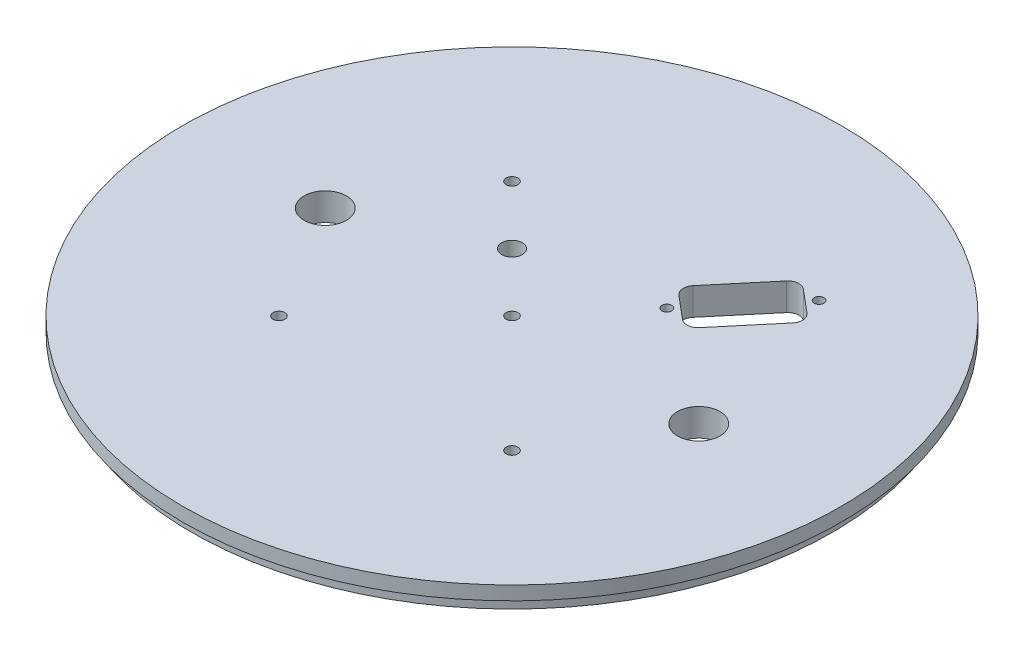
ISO-10303-21;
HEADER;
FILE_DESCRIPTION(('STEP AP214'),'2;1');
FILE_NAME('part.step','',(''),(''),'','','');
FILE_SCHEMA(('AUTOMOTIVE_DESIGN { 1 0 10303 214 1 1 1 1 }'));
ENDSEC;
DATA;
#1=APPLICATION_CONTEXT('core data for automotive mechanical design processes');
#2=APPLICATION_PROTOCOL_DEFINITION('international standard','automotive_design',2000,#1);
#3=PRODUCT_CONTEXT('',#1,'mechanical');
#4=PRODUCT('Part','Part','',(#3));
#5=PRODUCT_RELATED_PRODUCT_CATEGORY('part','',(#4));
#6=PRODUCT_DEFINITION_FORMATION('','',#4);
#7=PRODUCT_DEFINITION_CONTEXT('part definition',#1,'design');
#8=PRODUCT_DEFINITION('design','',#6,#7);
#9=PRODUCT_DEFINITION_SHAPE('','',#8);
#10=(LENGTH_UNIT() NAMED_UNIT(*) SI_UNIT(.MILLI.,.METRE.));
#11=(NAMED_UNIT(*) PLANE_ANGLE_UNIT() SI_UNIT($,.RADIAN.));
#12=(NAMED_UNIT(*) SI_UNIT($,.STERADIAN.) SOLID_ANGLE_UNIT());
#13=UNCERTAINTY_MEASURE_WITH_UNIT(LENGTH_MEASURE(1.E-05),#10,'distance_accuracy_value','');
#14=(GEOMETRIC_REPRESENTATION_CONTEXT(3) GLOBAL_UNCERTAINTY_ASSIGNED_CONTEXT((#13)) GLOBAL_UNIT_ASSIGNED_CONTEXT((#10,
#11,#12)) REPRESENTATION_CONTEXT('',''));
#15=CARTESIAN_POINT('',(0.,0.,0.));
#16=DIRECTION('',(0.,0.,1.));
#17=DIRECTION('',(1.,0.,0.));
#18=AXIS2_PLACEMENT_3D('',#15,#16,#17);
#19=CARTESIAN_POINT('',(0.,0.,0.));
#20=DIRECTION('',(0.,1.,0.));
#21=DIRECTION('',(0.,0.,1.));
#22=AXIS2_PLACEMENT_3D('',#19,#20,#21);
#23=PLANE('',#22);
#24=DIRECTION('',(-0.76604444311898,0.,-0.642787609686537));
#25=VECTOR('',#24,1.);
#26=CARTESIAN_POINT('',(28.300316681429,0.,-39.0615810789514));
#27=LINE('',#26,#25);
#28=CARTESIAN_POINT('',(33.553849472339,0.,-34.6533436517211));
#29=VERTEX_POINT('',#28);
#30=CARTESIAN_POINT('',(28.300316681429,0.,-39.0615810789514));
#31=VERTEX_POINT('',#30);
#32=EDGE_CURVE('E166',#29,#31,#27,.T.);
#33=ORIENTED_EDGE('',*,*,#32,.T.);
#34=CARTESIAN_POINT('',(26.6676361528252,0.,-37.1158281934292));
#35=DIRECTION('',(0.,1.,0.));
#36=DIRECTION('',(0.,0.,-1.));
#37=AXIS2_PLACEMENT_3D('',#34,#35,#36);
#38=CIRCLE('',#37,2.54);
#39=CARTESIAN_POINT('',(24.721883267303,0.,-38.748508722033));
#40=VERTEX_POINT('',#39);
#41=EDGE_CURVE('E159',#31,#40,#38,.T.);
#42=ORIENTED_EDGE('',*,*,#41,.T.);
#43=DIRECTION('',(-0.642787609686538,0.,0.766044443118979));
#44=VECTOR('',#43,1.);
#45=CARTESIAN_POINT('',(14.8563790094081,0.,-26.9912585799332));
#46=LINE('',#45,#44);
#47=CARTESIAN_POINT('',(14.8563790094081,0.,-26.9912585799332));
#48=VERTEX_POINT('',#47);
#49=EDGE_CURVE('E169',#40,#48,#46,.T.);
#50=ORIENTED_EDGE('',*,*,#49,.T.);
#51=CARTESIAN_POINT('',(16.8021318949303,0.,-25.3585780513294));
#52=DIRECTION('',(0.,1.,0.));
#53=DIRECTION('',(0.,0.,1.));
#54=AXIS2_PLACEMENT_3D('',#51,#52,#53);
#55=CIRCLE('',#54,2.54);
#56=CARTESIAN_POINT('',(15.1694513663265,0.,-23.4128251658072));
#57=VERTEX_POINT('',#56);
#58=EDGE_CURVE('E59',#48,#57,#55,.T.);
#59=ORIENTED_EDGE('',*,*,#58,.T.);
#60=DIRECTION('',(0.766044443118979,0.,0.642787609686537));
#61=VECTOR('',#60,1.);
#62=CARTESIAN_POINT('',(15.1694513663265,0.,-23.4128251658072));
#63=LINE('',#62,#61);
#64=CARTESIAN_POINT('',(20.4229841572365,0.,-19.0045877385769));
#65=VERTEX_POINT('',#64);
#66=EDGE_CURVE('E187',#57,#65,#63,.T.);
#67=ORIENTED_EDGE('',*,*,#66,.T.);
#68=CARTESIAN_POINT('',(22.0556646858403,0.,-20.9503406240991));
#69=DIRECTION('',(0.,1.,0.));
#70=DIRECTION('',(0.,0.,1.));
#71=AXIS2_PLACEMENT_3D('',#68,#69,#70);
#72=CIRCLE('',#71,2.54);
#73=CARTESIAN_POINT('',(24.0014175713625,0.,-19.3176600954953));
#74=VERTEX_POINT('',#73);
#75=EDGE_CURVE('E191',#65,#74,#72,.T.);
#76=ORIENTED_EDGE('',*,*,#75,.T.);
#77=DIRECTION('',(0.642787609686538,0.,-0.766044443118979));
#78=VECTOR('',#77,1.);
#79=CARTESIAN_POINT('',(24.0014175713625,0.,-19.3176600954953));
#80=LINE('',#79,#78);
#81=CARTESIAN_POINT('',(33.8669218292574,0.,-31.0749102375951));
#82=VERTEX_POINT('',#81);
#83=EDGE_CURVE('E195',#74,#82,#80,.T.);
#84=ORIENTED_EDGE('',*,*,#83,.T.);
#85=CARTESIAN_POINT('',(31.9211689437352,0.,-32.7075907661989));
#86=DIRECTION('',(0.,1.,0.));
#87=DIRECTION('',(0.,0.,1.));
#88=AXIS2_PLACEMENT_3D('',#85,#86,#87);
#89=CIRCLE('',#88,2.54);
#90=EDGE_CURVE('E199',#82,#29,#89,.T.);
#91=ORIENTED_EDGE('',*,*,#90,.T.);
#92=EDGE_LOOP('',(#33,#42,#50,#59,#67,#76,#84,#91));
#93=FACE_BOUND('',#92,.T.);
#94=CARTESIAN_POINT('',(16.3268052860381,0.,-19.4575288552221));
#95=DIRECTION('',(0.,1.,0.));
#96=DIRECTION('',(0.,0.,1.));
#97=AXIS2_PLACEMENT_3D('',#94,#95,#96);
#98=CIRCLE('',#97,1.1303);
#99=CARTESIAN_POINT('',(16.3268052860381,0.,-18.3272288552221));
#100=VERTEX_POINT('',#99);
#101=EDGE_CURVE('E252',#100,#100,#98,.T.);
#102=ORIENTED_EDGE('',*,*,#101,.T.);
#103=EDGE_LOOP('',(#102));
#104=FACE_BOUND('',#103,.T.);
#105=CARTESIAN_POINT('',(32.3964955526274,0.,-38.6086399623062));
#106=DIRECTION('',(0.,1.,0.));
#107=DIRECTION('',(0.,0.,1.));
#108=AXIS2_PLACEMENT_3D('',#105,#106,#107);
#109=CIRCLE('',#108,1.1303);
#110=CARTESIAN_POINT('',(32.3964955526274,0.,-37.4783399623062));
#111=VERTEX_POINT('',#110);
#112=EDGE_CURVE('E260',#111,#111,#109,.T.);
#113=ORIENTED_EDGE('',*,*,#112,.T.);
#114=EDGE_LOOP('',(#113));
#115=FACE_BOUND('',#114,.T.);
#116=DIRECTION('',(0.,0.,-1.));
#117=VECTOR('',#116,1.);
#118=CARTESIAN_POINT('',(3.23850000000001,0.,0.));
#119=LINE('',#118,#117);
#120=CARTESIAN_POINT('',(3.23850000000001,0.,-13.97));
#121=VERTEX_POINT('',#120);
#122=CARTESIAN_POINT('',(3.23850000000001,0.,-34.798));
#123=VERTEX_POINT('',#122);
#124=EDGE_CURVE('E52',#121,#123,#119,.T.);
#125=ORIENTED_EDGE('',*,*,#124,.T.);
#126=CARTESIAN_POINT('',(0.,0.,-34.798));
#127=DIRECTION('',(0.,1.,0.));
#128=DIRECTION('',(0.,0.,1.));
#129=AXIS2_PLACEMENT_3D('',#126,#127,#128);
#130=CIRCLE('',#129,3.2385);
#131=CARTESIAN_POINT('',(-3.23849999999999,0.,-34.798));
#132=VERTEX_POINT('',#131);
#133=EDGE_CURVE('E11',#123,#132,#130,.T.);
#134=ORIENTED_EDGE('',*,*,#133,.T.);
#135=DIRECTION('',(0.,0.,1.));
#136=VECTOR('',#135,1.);
#137=CARTESIAN_POINT('',(-3.23849999999999,0.,0.));
#138=LINE('',#137,#136);
#139=CARTESIAN_POINT('',(-3.23849999999999,0.,-13.97));
#140=VERTEX_POINT('',#139);
#141=EDGE_CURVE('E408',#132,#140,#138,.T.);
#142=ORIENTED_EDGE('',*,*,#141,.T.);
#143=CARTESIAN_POINT('',(0.,0.,-13.97));
#144=DIRECTION('',(0.,1.,0.));
#145=DIRECTION('',(0.,0.,1.));
#146=AXIS2_PLACEMENT_3D('',#143,#144,#145);
#147=CIRCLE('',#146,3.2385);
#148=EDGE_CURVE('E412',#140,#121,#147,.T.);
#149=ORIENTED_EDGE('',*,*,#148,.T.);
#150=EDGE_LOOP('',(#125,#134,#142,#149));
#151=FACE_BOUND('',#150,.T.);
#152=DIRECTION('',(0.,0.,1.));
#153=VECTOR('',#152,1.);
#154=CARTESIAN_POINT('',(-3.23850000000005,0.,0.));
#155=LINE('',#154,#153);
#156=CARTESIAN_POINT('',(-3.23850000000005,0.,13.97));
#157=VERTEX_POINT('',#156);
#158=CARTESIAN_POINT('',(-3.23850000000005,0.,34.798));
#159=VERTEX_POINT('',#158);
#160=EDGE_CURVE('E400',#157,#159,#155,.T.);
#161=ORIENTED_EDGE('',*,*,#160,.T.);
#162=CARTESIAN_POINT('',(0.,0.,34.798));
#163=DIRECTION('',(0.,1.,0.));
#164=DIRECTION('',(0.,0.,1.));
#165=AXIS2_PLACEMENT_3D('',#162,#163,#164);
#166=CIRCLE('',#165,3.2385);
#167=CARTESIAN_POINT('',(3.23849999999995,0.,34.798));
#168=VERTEX_POINT('',#167);
#169=EDGE_CURVE('E404',#159,#168,#166,.T.);
#170=ORIENTED_EDGE('',*,*,#169,.T.);
#171=DIRECTION('',(0.,0.,-1.));
#172=VECTOR('',#171,1.);
#173=CARTESIAN_POINT('',(3.23849999999995,0.,0.));
#174=LINE('',#173,#172);
#175=CARTESIAN_POINT('',(3.23849999999995,0.,13.97));
#176=VERTEX_POINT('',#175);
#177=EDGE_CURVE('E392',#168,#176,#174,.T.);
#178=ORIENTED_EDGE('',*,*,#177,.T.);
#179=CARTESIAN_POINT('',(0.,0.,13.97));
#180=DIRECTION('',(0.,1.,0.));
#181=DIRECTION('',(0.,0.,1.));
#182=AXIS2_PLACEMENT_3D('',#179,#180,#181);
#183=CIRCLE('',#182,3.2385);
#184=EDGE_CURVE('E396',#176,#157,#183,.T.);
#185=ORIENTED_EDGE('',*,*,#184,.T.);
#186=EDGE_LOOP('',(#161,#170,#178,#185));
#187=FACE_BOUND('',#186,.T.);
#188=CARTESIAN_POINT('',(0.,0.,0.));
#189=DIRECTION('',(0.,1.,0.));
#190=DIRECTION('',(0.,0.,1.));
#191=AXIS2_PLACEMENT_3D('',#188,#189,#190);
#192=CIRCLE('',#191,1.3589);
#193=CARTESIAN_POINT('',(0.,0.,1.3589));
#194=VERTEX_POINT('',#193);
#195=EDGE_CURVE('E332',#194,#194,#192,.T.);
#196=ORIENTED_EDGE('',*,*,#195,.T.);
#197=EDGE_LOOP('',(#196));
#198=FACE_BOUND('',#197,.T.);
#199=CARTESIAN_POINT('',(-26.9407683632074,0.,26.9407683632075));
#200=DIRECTION('',(0.,1.,0.));
#201=DIRECTION('',(0.,0.,1.));
#202=AXIS2_PLACEMENT_3D('',#199,#200,#201);
#203=CIRCLE('',#202,1.3589);
#204=CARTESIAN_POINT('',(-26.9407683632074,0.,28.2996683632075));
#205=VERTEX_POINT('',#204);
#206=EDGE_CURVE('E337',#205,#205,#203,.T.);
#207=ORIENTED_EDGE('',*,*,#206,.T.);
#208=EDGE_LOOP('',(#207));
#209=FACE_BOUND('',#208,.T.);
#210=CARTESIAN_POINT('',(-13.4703841816037,0.,-13.4703841816038));
#211=DIRECTION('',(0.,1.,0.));
#212=DIRECTION('',(0.,0.,1.));
#213=AXIS2_PLACEMENT_3D('',#210,#211,#212);
#214=CIRCLE('',#213,2.38125);
#215=CARTESIAN_POINT('',(-13.4703841816037,0.,-11.0891341816038));
#216=VERTEX_POINT('',#215);
#217=EDGE_CURVE('E345',#216,#216,#214,.T.);
#218=ORIENTED_EDGE('',*,*,#217,.T.);
#219=EDGE_LOOP('',(#218));
#220=FACE_BOUND('',#219,.T.);
#221=CARTESIAN_POINT('',(26.9407683632076,0.,26.9407683632073));
#222=DIRECTION('',(0.,1.,0.));
#223=DIRECTION('',(0.,0.,-1.));
#224=AXIS2_PLACEMENT_3D('',#221,#222,#223);
#225=CIRCLE('',#224,1.3589);
#226=CARTESIAN_POINT('',(26.9407683632076,0.,25.5818683632073));
#227=VERTEX_POINT('',#226);
#228=EDGE_CURVE('E353',#227,#227,#225,.T.);
#229=ORIENTED_EDGE('',*,*,#228,.T.);
#230=EDGE_LOOP('',(#229));
#231=FACE_BOUND('',#230,.T.);
#232=CARTESIAN_POINT('',(-26.9407683632074,0.,-26.9407683632075));
#233=DIRECTION('',(0.,1.,0.));
#234=DIRECTION('',(0.,0.,1.));
#235=AXIS2_PLACEMENT_3D('',#232,#233,#234);
#236=CIRCLE('',#235,1.3589);
#237=CARTESIAN_POINT('',(-26.9407683632074,0.,-25.5818683632075));
#238=VERTEX_POINT('',#237);
#239=EDGE_CURVE('E361',#238,#238,#236,.T.);
#240=ORIENTED_EDGE('',*,*,#239,.T.);
#241=EDGE_LOOP('',(#240));
#242=FACE_BOUND('',#241,.T.);
#243=CARTESIAN_POINT('',(-43.18,0.,0.));
#244=DIRECTION('',(0.,1.,0.));
#245=DIRECTION('',(0.,0.,-1.));
#246=AXIS2_PLACEMENT_3D('',#243,#244,#245);
#247=CIRCLE('',#246,4.9022);
#248=CARTESIAN_POINT('',(-43.18,0.,-4.9022));
#249=VERTEX_POINT('',#248);
#250=EDGE_CURVE('E369',#249,#249,#247,.T.);
#251=ORIENTED_EDGE('',*,*,#250,.T.);
#252=EDGE_LOOP('',(#251));
#253=FACE_BOUND('',#252,.T.);
#254=CARTESIAN_POINT('',(43.18,0.,0.));
#255=DIRECTION('',(0.,1.,0.));
#256=DIRECTION('',(0.,0.,1.));
#257=AXIS2_PLACEMENT_3D('',#254,#255,#256);
#258=CIRCLE('',#257,4.9022);
#259=CARTESIAN_POINT('',(43.18,0.,4.9022));
#260=VERTEX_POINT('',#259);
#261=EDGE_CURVE('E377',#260,#260,#258,.T.);
#262=ORIENTED_EDGE('',*,*,#261,.T.);
#263=EDGE_LOOP('',(#262));
#264=FACE_BOUND('',#263,.T.);
#265=CARTESIAN_POINT('',(0.,0.,0.));
#266=DIRECTION('',(0.,-1.,0.));
#267=DIRECTION('',(0.,0.,-1.));
#268=AXIS2_PLACEMENT_3D('',#265,#266,#267);
#269=CIRCLE('',#268,74.041);
#270=CARTESIAN_POINT('',(0.,0.,-74.041));
#271=VERTEX_POINT('',#270);
#272=EDGE_CURVE('E286',#271,#271,#269,.T.);
#273=ORIENTED_EDGE('',*,*,#272,.T.);
#274=EDGE_LOOP('',(#273));
#275=FACE_BOUND('',#274,.T.);
#276=ADVANCED_FACE('F43',(#93,#104,#115,#151,#187,#198,#209,#220,#231,#242,#253,#264,#275),#23,.F.);
#277=CARTESIAN_POINT('',(0.,6.35,0.));
#278=DIRECTION('',(0.,-1.,0.));
#279=DIRECTION('',(0.,0.,-1.));
#280=AXIS2_PLACEMENT_3D('',#277,#278,#279);
#281=CYLINDRICAL_SURFACE('',#280,76.2);
#282=CARTESIAN_POINT('',(0.,6.35,0.));
#283=DIRECTION('',(0.,1.,0.));
#284=DIRECTION('',(0.,0.,1.));
#285=AXIS2_PLACEMENT_3D('',#282,#283,#284);
#286=CIRCLE('',#285,76.2);
#287=CARTESIAN_POINT('',(0.,6.35,76.2));
#288=VERTEX_POINT('',#287);
#289=EDGE_CURVE('E385',#288,#288,#286,.T.);
#290=ORIENTED_EDGE('',*,*,#289,.F.);
#291=EDGE_LOOP('',(#290));
#292=FACE_BOUND('',#291,.T.);
#293=CARTESIAN_POINT('',(0.,3.175,0.));
#294=DIRECTION('',(0.,-1.,0.));
#295=DIRECTION('',(0.,0.,-1.));
#296=AXIS2_PLACEMENT_3D('',#293,#294,#295);
#297=CIRCLE('',#296,76.2);
#298=CARTESIAN_POINT('',(0.,3.175,-76.2));
#299=VERTEX_POINT('',#298);
#300=EDGE_CURVE('E325',#299,#299,#297,.T.);
#301=ORIENTED_EDGE('',*,*,#300,.F.);
#302=EDGE_LOOP('',(#301));
#303=FACE_BOUND('',#302,.T.);
#304=ADVANCED_FACE('F45',(#292,#303),#281,.T.);
#305=CARTESIAN_POINT('',(0.,6.35,0.));
#306=DIRECTION('',(0.,1.,0.));
#307=DIRECTION('',(0.,0.,1.));
#308=AXIS2_PLACEMENT_3D('',#305,#306,#307);
#309=PLANE('',#308);
#310=CARTESIAN_POINT('',(26.6676361528252,6.35,-37.1158281934292));
#311=DIRECTION('',(0.,1.,0.));
#312=DIRECTION('',(0.,0.,-1.));
#313=AXIS2_PLACEMENT_3D('',#310,#311,#312);
#314=CIRCLE('',#313,2.54);
#315=CARTESIAN_POINT('',(28.300316681429,6.35,-39.0615810789514));
#316=VERTEX_POINT('',#315);
#317=CARTESIAN_POINT('',(24.721883267303,6.35,-38.748508722033));
#318=VERTEX_POINT('',#317);
#319=EDGE_CURVE('E67',#316,#318,#314,.T.);
#320=ORIENTED_EDGE('',*,*,#319,.F.);
#321=DIRECTION('',(-0.76604444311898,0.,-0.642787609686537));
#322=VECTOR('',#321,1.);
#323=CARTESIAN_POINT('',(28.300316681429,6.35,-39.0615810789514));
#324=LINE('',#323,#322);
#325=CARTESIAN_POINT('',(33.553849472339,6.35,-34.6533436517211));
#326=VERTEX_POINT('',#325);
#327=EDGE_CURVE('E178',#326,#316,#324,.T.);
#328=ORIENTED_EDGE('',*,*,#327,.F.);
#329=CARTESIAN_POINT('',(31.9211689437352,6.35,-32.7075907661989));
#330=DIRECTION('',(0.,1.,0.));
#331=DIRECTION('',(0.,0.,1.));
#332=AXIS2_PLACEMENT_3D('',#329,#330,#331);
#333=CIRCLE('',#332,2.54);
#334=CARTESIAN_POINT('',(33.8669218292574,6.35,-31.0749102375951));
#335=VERTEX_POINT('',#334);
#336=EDGE_CURVE('E182',#335,#326,#333,.T.);
#337=ORIENTED_EDGE('',*,*,#336,.F.);
#338=DIRECTION('',(0.642787609686538,0.,-0.766044443118979));
#339=VECTOR('',#338,1.);
#340=CARTESIAN_POINT('',(24.0014175713625,6.35,-19.3176600954953));
#341=LINE('',#340,#339);
#342=CARTESIAN_POINT('',(24.0014175713625,6.35,-19.3176600954953));
#343=VERTEX_POINT('',#342);
#344=EDGE_CURVE('E221',#343,#335,#341,.T.);
#345=ORIENTED_EDGE('',*,*,#344,.F.);
#346=CARTESIAN_POINT('',(22.0556646858403,6.35,-20.9503406240991));
#347=DIRECTION('',(0.,1.,0.));
#348=DIRECTION('',(0.,0.,1.));
#349=AXIS2_PLACEMENT_3D('',#346,#347,#348);
#350=CIRCLE('',#349,2.54);
#351=CARTESIAN_POINT('',(20.4229841572365,6.35,-19.0045877385769));
#352=VERTEX_POINT('',#351);
#353=EDGE_CURVE('E217',#352,#343,#350,.T.);
#354=ORIENTED_EDGE('',*,*,#353,.F.);
#355=DIRECTION('',(0.766044443118979,0.,0.642787609686537));
#356=VECTOR('',#355,1.);
#357=CARTESIAN_POINT('',(15.1694513663265,6.35,-23.4128251658072));
#358=LINE('',#357,#356);
#359=CARTESIAN_POINT('',(15.1694513663265,6.35,-23.4128251658072));
#360=VERTEX_POINT('',#359);
#361=EDGE_CURVE('E213',#360,#352,#358,.T.);
#362=ORIENTED_EDGE('',*,*,#361,.F.);
#363=CARTESIAN_POINT('',(16.8021318949303,6.35,-25.3585780513294));
#364=DIRECTION('',(0.,1.,0.));
#365=DIRECTION('',(0.,0.,1.));
#366=AXIS2_PLACEMENT_3D('',#363,#364,#365);
#367=CIRCLE('',#366,2.54);
#368=CARTESIAN_POINT('',(14.8563790094081,6.35,-26.9912585799332));
#369=VERTEX_POINT('',#368);
#370=EDGE_CURVE('E209',#369,#360,#367,.T.);
#371=ORIENTED_EDGE('',*,*,#370,.F.);
#372=DIRECTION('',(-0.642787609686538,0.,0.766044443118979));
#373=VECTOR('',#372,1.);
#374=CARTESIAN_POINT('',(14.8563790094081,6.35,-26.9912585799332));
#375=LINE('',#374,#373);
#376=EDGE_CURVE('E206',#318,#369,#375,.T.);
#377=ORIENTED_EDGE('',*,*,#376,.F.);
#378=EDGE_LOOP('',(#320,#328,#337,#345,#354,#362,#371,#377));
#379=FACE_BOUND('',#378,.T.);
#380=CARTESIAN_POINT('',(16.3268052860381,6.35,-19.4575288552221));
#381=DIRECTION('',(0.,1.,0.));
#382=DIRECTION('',(0.,0.,1.));
#383=AXIS2_PLACEMENT_3D('',#380,#381,#382);
#384=CIRCLE('',#383,1.1303);
#385=CARTESIAN_POINT('',(16.3268052860381,6.35,-18.3272288552221));
#386=VERTEX_POINT('',#385);
#387=EDGE_CURVE('E231',#386,#386,#384,.T.);
#388=ORIENTED_EDGE('',*,*,#387,.F.);
#389=EDGE_LOOP('',(#388));
#390=FACE_BOUND('',#389,.T.);
#391=CARTESIAN_POINT('',(32.3964955526274,6.35,-38.6086399623062));
#392=DIRECTION('',(0.,1.,0.));
#393=DIRECTION('',(0.,0.,1.));
#394=AXIS2_PLACEMENT_3D('',#391,#392,#393);
#395=CIRCLE('',#394,1.1303);
#396=CARTESIAN_POINT('',(32.3964955526274,6.35,-37.4783399623062));
#397=VERTEX_POINT('',#396);
#398=EDGE_CURVE('E256',#397,#397,#395,.T.);
#399=ORIENTED_EDGE('',*,*,#398,.F.);
#400=EDGE_LOOP('',(#399));
#401=FACE_BOUND('',#400,.T.);
#402=CARTESIAN_POINT('',(-26.9407683632074,6.35,26.9407683632075));
#403=DIRECTION('',(0.,1.,0.));
#404=DIRECTION('',(0.,0.,1.));
#405=AXIS2_PLACEMENT_3D('',#402,#403,#404);
#406=CIRCLE('',#405,1.3589);
#407=CARTESIAN_POINT('',(-26.9407683632074,6.35,28.2996683632075));
#408=VERTEX_POINT('',#407);
#409=EDGE_CURVE('E341',#408,#408,#406,.T.);
#410=ORIENTED_EDGE('',*,*,#409,.F.);
#411=EDGE_LOOP('',(#410));
#412=FACE_BOUND('',#411,.T.);
#413=CARTESIAN_POINT('',(26.9407683632076,6.35,26.9407683632073));
#414=DIRECTION('',(0.,1.,0.));
#415=DIRECTION('',(0.,0.,-1.));
#416=AXIS2_PLACEMENT_3D('',#413,#414,#415);
#417=CIRCLE('',#416,1.3589);
#418=CARTESIAN_POINT('',(26.9407683632076,6.35,25.5818683632073));
#419=VERTEX_POINT('',#418);
#420=EDGE_CURVE('E357',#419,#419,#417,.T.);
#421=ORIENTED_EDGE('',*,*,#420,.F.);
#422=EDGE_LOOP('',(#421));
#423=FACE_BOUND('',#422,.T.);
#424=CARTESIAN_POINT('',(-43.18,6.35,0.));
#425=DIRECTION('',(0.,1.,0.));
#426=DIRECTION('',(0.,0.,-1.));
#427=AXIS2_PLACEMENT_3D('',#424,#425,#426);
#428=CIRCLE('',#427,4.9022);
#429=CARTESIAN_POINT('',(-43.18,6.35,-4.9022));
#430=VERTEX_POINT('',#429);
#431=EDGE_CURVE('E373',#430,#430,#428,.T.);
#432=ORIENTED_EDGE('',*,*,#431,.F.);
#433=EDGE_LOOP('',(#432));
#434=FACE_BOUND('',#433,.T.);
#435=ORIENTED_EDGE('',*,*,#289,.T.);
#436=EDGE_LOOP('',(#435));
#437=FACE_BOUND('',#436,.T.);
#438=CARTESIAN_POINT('',(43.18,6.35,0.));
#439=DIRECTION('',(0.,1.,0.));
#440=DIRECTION('',(0.,0.,1.));
#441=AXIS2_PLACEMENT_3D('',#438,#439,#440);
#442=CIRCLE('',#441,4.9022);
#443=CARTESIAN_POINT('',(43.18,6.35,4.9022));
#444=VERTEX_POINT('',#443);
#445=EDGE_CURVE('E381',#444,#444,#442,.T.);
#446=ORIENTED_EDGE('',*,*,#445,.F.);
#447=EDGE_LOOP('',(#446));
#448=FACE_BOUND('',#447,.T.);
#449=CARTESIAN_POINT('',(-26.9407683632074,6.35,-26.9407683632075));
#450=DIRECTION('',(0.,1.,0.));
#451=DIRECTION('',(0.,0.,1.));
#452=AXIS2_PLACEMENT_3D('',#449,#450,#451);
#453=CIRCLE('',#452,1.3589);
#454=CARTESIAN_POINT('',(-26.9407683632074,6.35,-25.5818683632075));
#455=VERTEX_POINT('',#454);
#456=EDGE_CURVE('E365',#455,#455,#453,.T.);
#457=ORIENTED_EDGE('',*,*,#456,.F.);
#458=EDGE_LOOP('',(#457));
#459=FACE_BOUND('',#458,.T.);
#460=CARTESIAN_POINT('',(-13.4703841816037,6.35,-13.4703841816038));
#461=DIRECTION('',(0.,1.,0.));
#462=DIRECTION('',(0.,0.,1.));
#463=AXIS2_PLACEMENT_3D('',#460,#461,#462);
#464=CIRCLE('',#463,2.38125);
#465=CARTESIAN_POINT('',(-13.4703841816037,6.35,-11.0891341816038));
#466=VERTEX_POINT('',#465);
#467=EDGE_CURVE('E349',#466,#466,#464,.T.);
#468=ORIENTED_EDGE('',*,*,#467,.F.);
#469=EDGE_LOOP('',(#468));
#470=FACE_BOUND('',#469,.T.);
#471=CARTESIAN_POINT('',(0.,6.35,0.));
#472=DIRECTION('',(0.,1.,0.));
#473=DIRECTION('',(0.,0.,1.));
#474=AXIS2_PLACEMENT_3D('',#471,#472,#473);
#475=CIRCLE('',#474,1.3589);
#476=CARTESIAN_POINT('',(0.,6.35,1.3589));
#477=VERTEX_POINT('',#476);
#478=EDGE_CURVE('E333',#477,#477,#475,.T.);
#479=ORIENTED_EDGE('',*,*,#478,.F.);
#480=EDGE_LOOP('',(#479));
#481=FACE_BOUND('',#480,.T.);
#482=ADVANCED_FACE('F451',(#379,#390,#401,#412,#423,#434,#437,#448,#459,#470,#481),#309,.T.);
#483=CARTESIAN_POINT('',(43.18,6.35,0.));
#484=DIRECTION('',(0.,-1.,0.));
#485=DIRECTION('',(0.,0.,-1.));
#486=AXIS2_PLACEMENT_3D('',#483,#484,#485);
#487=CYLINDRICAL_SURFACE('',#486,4.9022);
#488=ORIENTED_EDGE('',*,*,#445,.T.);
#489=EDGE_LOOP('',(#488));
#490=FACE_BOUND('',#489,.T.);
#491=ORIENTED_EDGE('',*,*,#261,.F.);
#492=EDGE_LOOP('',(#491));
#493=FACE_BOUND('',#492,.T.);
#494=ADVANCED_FACE('F456',(#490,#493),#487,.F.);
#495=CARTESIAN_POINT('',(-43.18,6.35,0.));
#496=DIRECTION('',(0.,-1.,0.));
#497=DIRECTION('',(0.,0.,-1.));
#498=AXIS2_PLACEMENT_3D('',#495,#496,#497);
#499=CYLINDRICAL_SURFACE('',#498,4.9022);
#500=ORIENTED_EDGE('',*,*,#431,.T.);
#501=EDGE_LOOP('',(#500));
#502=FACE_BOUND('',#501,.T.);
#503=ORIENTED_EDGE('',*,*,#250,.F.);
#504=EDGE_LOOP('',(#503));
#505=FACE_BOUND('',#504,.T.);
#506=ADVANCED_FACE('F460',(#502,#505),#499,.F.);
#507=CARTESIAN_POINT('',(-26.9407683632074,6.35,-26.9407683632075));
#508=DIRECTION('',(0.,-1.,0.));
#509=DIRECTION('',(0.,0.,-1.));
#510=AXIS2_PLACEMENT_3D('',#507,#508,#509);
#511=CYLINDRICAL_SURFACE('',#510,1.3589);
#512=ORIENTED_EDGE('',*,*,#456,.T.);
#513=EDGE_LOOP('',(#512));
#514=FACE_BOUND('',#513,.T.);
#515=ORIENTED_EDGE('',*,*,#239,.F.);
#516=EDGE_LOOP('',(#515));
#517=FACE_BOUND('',#516,.T.);
#518=ADVANCED_FACE('F464',(#514,#517),#511,.F.);
#519=CARTESIAN_POINT('',(26.9407683632076,6.35,26.9407683632073));
#520=DIRECTION('',(0.,-1.,0.));
#521=DIRECTION('',(0.,0.,-1.));
#522=AXIS2_PLACEMENT_3D('',#519,#520,#521);
#523=CYLINDRICAL_SURFACE('',#522,1.3589);
#524=ORIENTED_EDGE('',*,*,#420,.T.);
#525=EDGE_LOOP('',(#524));
#526=FACE_BOUND('',#525,.T.);
#527=ORIENTED_EDGE('',*,*,#228,.F.);
#528=EDGE_LOOP('',(#527));
#529=FACE_BOUND('',#528,.T.);
#530=ADVANCED_FACE('F468',(#526,#529),#523,.F.);
#531=CARTESIAN_POINT('',(-13.4703841816037,6.35,-13.4703841816038));
#532=DIRECTION('',(0.,-1.,0.));
#533=DIRECTION('',(0.,0.,-1.));
#534=AXIS2_PLACEMENT_3D('',#531,#532,#533);
#535=CYLINDRICAL_SURFACE('',#534,2.38125);
#536=ORIENTED_EDGE('',*,*,#467,.T.);
#537=EDGE_LOOP('',(#536));
#538=FACE_BOUND('',#537,.T.);
#539=ORIENTED_EDGE('',*,*,#217,.F.);
#540=EDGE_LOOP('',(#539));
#541=FACE_BOUND('',#540,.T.);
#542=ADVANCED_FACE('F472',(#538,#541),#535,.F.);
#543=CARTESIAN_POINT('',(-26.9407683632074,6.35,26.9407683632075));
#544=DIRECTION('',(0.,-1.,0.));
#545=DIRECTION('',(0.,0.,-1.));
#546=AXIS2_PLACEMENT_3D('',#543,#544,#545);
#547=CYLINDRICAL_SURFACE('',#546,1.3589);
#548=ORIENTED_EDGE('',*,*,#409,.T.);
#549=EDGE_LOOP('',(#548));
#550=FACE_BOUND('',#549,.T.);
#551=ORIENTED_EDGE('',*,*,#206,.F.);
#552=EDGE_LOOP('',(#551));
#553=FACE_BOUND('',#552,.T.);
#554=ADVANCED_FACE('F476',(#550,#553),#547,.F.);
#555=CARTESIAN_POINT('',(0.,6.35,0.));
#556=DIRECTION('',(0.,-1.,0.));
#557=DIRECTION('',(0.,0.,-1.));
#558=AXIS2_PLACEMENT_3D('',#555,#556,#557);
#559=CYLINDRICAL_SURFACE('',#558,1.3589);
#560=ORIENTED_EDGE('',*,*,#478,.T.);
#561=EDGE_LOOP('',(#560));
#562=FACE_BOUND('',#561,.T.);
#563=ORIENTED_EDGE('',*,*,#195,.F.);
#564=EDGE_LOOP('',(#563));
#565=FACE_BOUND('',#564,.T.);
#566=ADVANCED_FACE('F480',(#562,#565),#559,.F.);
#567=CARTESIAN_POINT('',(0.,3.175,0.));
#568=DIRECTION('',(0.,-1.,0.));
#569=DIRECTION('',(0.,0.,-1.));
#570=AXIS2_PLACEMENT_3D('',#567,#568,#569);
#571=PLANE('',#570);
#572=CARTESIAN_POINT('',(0.,3.175,0.));
#573=DIRECTION('',(0.,-1.,0.));
#574=DIRECTION('',(0.,0.,-1.));
#575=AXIS2_PLACEMENT_3D('',#572,#573,#574);
#576=CIRCLE('',#575,74.041);
#577=CARTESIAN_POINT('',(0.,3.175,-74.041));
#578=VERTEX_POINT('',#577);
#579=EDGE_CURVE('E321',#578,#578,#576,.T.);
#580=ORIENTED_EDGE('',*,*,#579,.F.);
#581=EDGE_LOOP('',(#580));
#582=FACE_BOUND('',#581,.T.);
#583=ORIENTED_EDGE('',*,*,#300,.T.);
#584=EDGE_LOOP('',(#583));
#585=FACE_BOUND('',#584,.T.);
#586=ADVANCED_FACE('F484',(#582,#585),#571,.T.);
#587=CARTESIAN_POINT('',(0.,3.175,0.));
#588=DIRECTION('',(0.,-1.,0.));
#589=DIRECTION('',(0.,0.,-1.));
#590=AXIS2_PLACEMENT_3D('',#587,#588,#589);
#591=CYLINDRICAL_SURFACE('',#590,74.041);
#592=ORIENTED_EDGE('',*,*,#579,.T.);
#593=EDGE_LOOP('',(#592));
#594=FACE_BOUND('',#593,.T.);
#595=ORIENTED_EDGE('',*,*,#272,.F.);
#596=EDGE_LOOP('',(#595));
#597=FACE_BOUND('',#596,.T.);
#598=ADVANCED_FACE('F488',(#594,#597),#591,.T.);
#599=CARTESIAN_POINT('',(0.,-0.381,34.798));
#600=DIRECTION('',(0.,1.,0.));
#601=DIRECTION('',(0.,0.,1.));
#602=AXIS2_PLACEMENT_3D('',#599,#600,#601);
#603=CYLINDRICAL_SURFACE('',#602,3.2385);
#604=DIRECTION('',(0.,1.,0.));
#605=VECTOR('',#604,1.);
#606=CARTESIAN_POINT('',(-3.23850000000005,-0.381,34.798));
#607=LINE('',#606,#605);
#608=CARTESIAN_POINT('',(-3.23850000000005,3.175,34.798));
#609=VERTEX_POINT('',#608);
#610=EDGE_CURVE('E270',#159,#609,#607,.T.);
#611=ORIENTED_EDGE('',*,*,#610,.T.);
#612=CARTESIAN_POINT('',(0.,3.175,34.798));
#613=DIRECTION('',(0.,1.,0.));
#614=DIRECTION('',(0.,0.,-1.));
#615=AXIS2_PLACEMENT_3D('',#612,#613,#614);
#616=CIRCLE('',#615,3.2385);
#617=CARTESIAN_POINT('',(3.23849999999995,3.175,34.798));
#618=VERTEX_POINT('',#617);
#619=EDGE_CURVE('E264',#609,#618,#616,.T.);
#620=ORIENTED_EDGE('',*,*,#619,.T.);
#621=DIRECTION('',(0.,1.,0.));
#622=VECTOR('',#621,1.);
#623=CARTESIAN_POINT('',(3.23849999999995,-0.381,34.798));
#624=LINE('',#623,#622);
#625=EDGE_CURVE('E310',#168,#618,#624,.T.);
#626=ORIENTED_EDGE('',*,*,#625,.F.);
#627=ORIENTED_EDGE('',*,*,#169,.F.);
#628=EDGE_LOOP('',(#611,#620,#626,#627));
#629=FACE_BOUND('',#628,.T.);
#630=ADVANCED_FACE('F492',(#629),#603,.F.);
#631=CARTESIAN_POINT('',(-3.23850000000005,-0.381,34.798));
#632=DIRECTION('',(-1.,0.,0.));
#633=DIRECTION('',(0.,0.,1.));
#634=AXIS2_PLACEMENT_3D('',#631,#632,#633);
#635=PLANE('',#634);
#636=DIRECTION('',(0.,1.,0.));
#637=VECTOR('',#636,1.);
#638=CARTESIAN_POINT('',(-3.23850000000005,-0.381,13.97));
#639=LINE('',#638,#637);
#640=CARTESIAN_POINT('',(-3.23850000000005,3.175,13.97));
#641=VERTEX_POINT('',#640);
#642=EDGE_CURVE('E313',#157,#641,#639,.T.);
#643=ORIENTED_EDGE('',*,*,#642,.T.);
#644=DIRECTION('',(0.,0.,1.));
#645=VECTOR('',#644,1.);
#646=CARTESIAN_POINT('',(-3.23850000000005,3.175,34.798));
#647=LINE('',#646,#645);
#648=EDGE_CURVE('E306',#641,#609,#647,.T.);
#649=ORIENTED_EDGE('',*,*,#648,.T.);
#650=ORIENTED_EDGE('',*,*,#610,.F.);
#651=ORIENTED_EDGE('',*,*,#160,.F.);
#652=EDGE_LOOP('',(#643,#649,#650,#651));
#653=FACE_BOUND('',#652,.T.);
#654=ADVANCED_FACE('F496',(#653),#635,.F.);
#655=CARTESIAN_POINT('',(0.,-0.381,13.97));
#656=DIRECTION('',(0.,1.,0.));
#657=DIRECTION('',(0.,0.,1.));
#658=AXIS2_PLACEMENT_3D('',#655,#656,#657);
#659=CYLINDRICAL_SURFACE('',#658,3.2385);
#660=DIRECTION('',(0.,1.,0.));
#661=VECTOR('',#660,1.);
#662=CARTESIAN_POINT('',(3.23849999999995,-0.381,13.97));
#663=LINE('',#662,#661);
#664=CARTESIAN_POINT('',(3.23849999999995,3.175,13.97));
#665=VERTEX_POINT('',#664);
#666=EDGE_CURVE('E316',#176,#665,#663,.T.);
#667=ORIENTED_EDGE('',*,*,#666,.T.);
#668=CARTESIAN_POINT('',(0.,3.175,13.97));
#669=DIRECTION('',(0.,1.,0.));
#670=DIRECTION('',(0.,0.,-1.));
#671=AXIS2_PLACEMENT_3D('',#668,#669,#670);
#672=CIRCLE('',#671,3.2385);
#673=EDGE_CURVE('E302',#665,#641,#672,.T.);
#674=ORIENTED_EDGE('',*,*,#673,.T.);
#675=ORIENTED_EDGE('',*,*,#642,.F.);
#676=ORIENTED_EDGE('',*,*,#184,.F.);
#677=EDGE_LOOP('',(#667,#674,#675,#676));
#678=FACE_BOUND('',#677,.T.);
#679=ADVANCED_FACE('F502',(#678),#659,.F.);
#680=CARTESIAN_POINT('',(3.23849999999995,-0.381,34.798));
#681=DIRECTION('',(1.,0.,0.));
#682=DIRECTION('',(0.,0.,-1.));
#683=AXIS2_PLACEMENT_3D('',#680,#681,#682);
#684=PLANE('',#683);
#685=ORIENTED_EDGE('',*,*,#625,.T.);
#686=DIRECTION('',(0.,0.,-1.));
#687=VECTOR('',#686,1.);
#688=CARTESIAN_POINT('',(3.23849999999995,3.175,34.798));
#689=LINE('',#688,#687);
#690=EDGE_CURVE('E298',#618,#665,#689,.T.);
#691=ORIENTED_EDGE('',*,*,#690,.T.);
#692=ORIENTED_EDGE('',*,*,#666,.F.);
#693=ORIENTED_EDGE('',*,*,#177,.F.);
#694=EDGE_LOOP('',(#685,#691,#692,#693));
#695=FACE_BOUND('',#694,.T.);
#696=ADVANCED_FACE('F498',(#695),#684,.F.);
#697=CARTESIAN_POINT('',(0.,3.175,34.798));
#698=DIRECTION('',(0.,-1.,0.));
#699=DIRECTION('',(0.,0.,-1.));
#700=AXIS2_PLACEMENT_3D('',#697,#698,#699);
#701=PLANE('',#700);
#702=ORIENTED_EDGE('',*,*,#619,.F.);
#703=ORIENTED_EDGE('',*,*,#648,.F.);
#704=ORIENTED_EDGE('',*,*,#673,.F.);
#705=ORIENTED_EDGE('',*,*,#690,.F.);
#706=EDGE_LOOP('',(#702,#703,#704,#705));
#707=FACE_BOUND('',#706,.T.);
#708=ADVANCED_FACE('F501',(#707),#701,.T.);
#709=CARTESIAN_POINT('',(0.,-0.381,-34.798));
#710=DIRECTION('',(0.,1.,0.));
#711=DIRECTION('',(0.,0.,1.));
#712=AXIS2_PLACEMENT_3D('',#709,#710,#711);
#713=CYLINDRICAL_SURFACE('',#712,3.2385);
#714=DIRECTION('',(0.,1.,0.));
#715=VECTOR('',#714,1.);
#716=CARTESIAN_POINT('',(3.23850000000001,-0.381,-34.798));
#717=LINE('',#716,#715);
#718=CARTESIAN_POINT('',(3.23850000000001,3.175,-34.798));
#719=VERTEX_POINT('',#718);
#720=EDGE_CURVE('E283',#123,#719,#717,.T.);
#721=ORIENTED_EDGE('',*,*,#720,.T.);
#722=CARTESIAN_POINT('',(0.,3.175,-34.798));
#723=DIRECTION('',(0.,1.,0.));
#724=DIRECTION('',(0.,0.,1.));
#725=AXIS2_PLACEMENT_3D('',#722,#723,#724);
#726=CIRCLE('',#725,3.2385);
#727=CARTESIAN_POINT('',(-3.23849999999999,3.175,-34.798));
#728=VERTEX_POINT('',#727);
#729=EDGE_CURVE('E265',#719,#728,#726,.T.);
#730=ORIENTED_EDGE('',*,*,#729,.T.);
#731=DIRECTION('',(0.,1.,0.));
#732=VECTOR('',#731,1.);
#733=CARTESIAN_POINT('',(-3.23849999999999,-0.381,-34.798));
#734=LINE('',#733,#732);
#735=EDGE_CURVE('E282',#132,#728,#734,.T.);
#736=ORIENTED_EDGE('',*,*,#735,.F.);
#737=ORIENTED_EDGE('',*,*,#133,.F.);
#738=EDGE_LOOP('',(#721,#730,#736,#737));
#739=FACE_BOUND('',#738,.T.);
#740=ADVANCED_FACE('F434',(#739),#713,.F.);
#741=CARTESIAN_POINT('',(3.23850000000001,-0.381,-34.798));
#742=DIRECTION('',(1.,0.,0.));
#743=DIRECTION('',(0.,0.,-1.));
#744=AXIS2_PLACEMENT_3D('',#741,#742,#743);
#745=PLANE('',#744);
#746=DIRECTION('',(0.,1.,0.));
#747=VECTOR('',#746,1.);
#748=CARTESIAN_POINT('',(3.23850000000001,-0.381,-13.97));
#749=LINE('',#748,#747);
#750=CARTESIAN_POINT('',(3.23850000000001,3.175,-13.97));
#751=VERTEX_POINT('',#750);
#752=EDGE_CURVE('E287',#121,#751,#749,.T.);
#753=ORIENTED_EDGE('',*,*,#752,.T.);
#754=DIRECTION('',(0.,0.,-1.));
#755=VECTOR('',#754,1.);
#756=CARTESIAN_POINT('',(3.23850000000001,3.175,-34.798));
#757=LINE('',#756,#755);
#758=EDGE_CURVE('E278',#751,#719,#757,.T.);
#759=ORIENTED_EDGE('',*,*,#758,.T.);
#760=ORIENTED_EDGE('',*,*,#720,.F.);
#761=ORIENTED_EDGE('',*,*,#124,.F.);
#762=EDGE_LOOP('',(#753,#759,#760,#761));
#763=FACE_BOUND('',#762,.T.);
#764=ADVANCED_FACE('F423',(#763),#745,.F.);
#765=CARTESIAN_POINT('',(0.,-0.381,-13.97));
#766=DIRECTION('',(0.,1.,0.));
#767=DIRECTION('',(0.,0.,1.));
#768=AXIS2_PLACEMENT_3D('',#765,#766,#767);
#769=CYLINDRICAL_SURFACE('',#768,3.2385);
#770=DIRECTION('',(0.,1.,0.));
#771=VECTOR('',#770,1.);
#772=CARTESIAN_POINT('',(-3.23849999999999,-0.381,-13.97));
#773=LINE('',#772,#771);
#774=CARTESIAN_POINT('',(-3.23849999999999,3.175,-13.97));
#775=VERTEX_POINT('',#774);
#776=EDGE_CURVE('E290',#140,#775,#773,.T.);
#777=ORIENTED_EDGE('',*,*,#776,.T.);
#778=CARTESIAN_POINT('',(0.,3.175,-13.97));
#779=DIRECTION('',(0.,1.,0.));
#780=DIRECTION('',(0.,0.,1.));
#781=AXIS2_PLACEMENT_3D('',#778,#779,#780);
#782=CIRCLE('',#781,3.2385);
#783=EDGE_CURVE('E274',#775,#751,#782,.T.);
#784=ORIENTED_EDGE('',*,*,#783,.T.);
#785=ORIENTED_EDGE('',*,*,#752,.F.);
#786=ORIENTED_EDGE('',*,*,#148,.F.);
#787=EDGE_LOOP('',(#777,#784,#785,#786));
#788=FACE_BOUND('',#787,.T.);
#789=ADVANCED_FACE('F425',(#788),#769,.F.);
#790=CARTESIAN_POINT('',(-3.23849999999999,-0.381,-34.798));
#791=DIRECTION('',(-1.,0.,0.));
#792=DIRECTION('',(0.,0.,1.));
#793=AXIS2_PLACEMENT_3D('',#790,#791,#792);
#794=PLANE('',#793);
#795=ORIENTED_EDGE('',*,*,#735,.T.);
#796=DIRECTION('',(0.,0.,1.));
#797=VECTOR('',#796,1.);
#798=CARTESIAN_POINT('',(-3.23849999999999,3.175,-34.798));
#799=LINE('',#798,#797);
#800=EDGE_CURVE('E269',#728,#775,#799,.T.);
#801=ORIENTED_EDGE('',*,*,#800,.T.);
#802=ORIENTED_EDGE('',*,*,#776,.F.);
#803=ORIENTED_EDGE('',*,*,#141,.F.);
#804=EDGE_LOOP('',(#795,#801,#802,#803));
#805=FACE_BOUND('',#804,.T.);
#806=ADVANCED_FACE('F436',(#805),#794,.F.);
#807=CARTESIAN_POINT('',(0.,3.175,-34.798));
#808=DIRECTION('',(0.,1.,0.));
#809=DIRECTION('',(0.,0.,1.));
#810=AXIS2_PLACEMENT_3D('',#807,#808,#809);
#811=PLANE('',#810);
#812=ORIENTED_EDGE('',*,*,#729,.F.);
#813=ORIENTED_EDGE('',*,*,#758,.F.);
#814=ORIENTED_EDGE('',*,*,#783,.F.);
#815=ORIENTED_EDGE('',*,*,#800,.F.);
#816=EDGE_LOOP('',(#812,#813,#814,#815));
#817=FACE_BOUND('',#816,.T.);
#818=ADVANCED_FACE('F431',(#817),#811,.F.);
#819=CARTESIAN_POINT('',(32.3964955526274,6.35,-38.6086399623062));
#820=DIRECTION('',(0.,1.,0.));
#821=DIRECTION('',(0.,0.,1.));
#822=AXIS2_PLACEMENT_3D('',#819,#820,#821);
#823=CYLINDRICAL_SURFACE('',#822,1.1303);
#824=ORIENTED_EDGE('',*,*,#112,.F.);
#825=EDGE_LOOP('',(#824));
#826=FACE_BOUND('',#825,.T.);
#827=ORIENTED_EDGE('',*,*,#398,.T.);
#828=EDGE_LOOP('',(#827));
#829=FACE_BOUND('',#828,.T.);
#830=ADVANCED_FACE('F443',(#826,#829),#823,.F.);
#831=CARTESIAN_POINT('',(16.3268052860381,6.35,-19.4575288552221));
#832=DIRECTION('',(0.,1.,0.));
#833=DIRECTION('',(0.,0.,1.));
#834=AXIS2_PLACEMENT_3D('',#831,#832,#833);
#835=CYLINDRICAL_SURFACE('',#834,1.1303);
#836=ORIENTED_EDGE('',*,*,#101,.F.);
#837=EDGE_LOOP('',(#836));
#838=FACE_BOUND('',#837,.T.);
#839=ORIENTED_EDGE('',*,*,#387,.T.);
#840=EDGE_LOOP('',(#839));
#841=FACE_BOUND('',#840,.T.);
#842=ADVANCED_FACE('F522',(#838,#841),#835,.F.);
#843=CARTESIAN_POINT('',(26.6676361528252,0.,-37.1158281934292));
#844=DIRECTION('',(0.,1.,0.));
#845=DIRECTION('',(0.,0.,1.));
#846=AXIS2_PLACEMENT_3D('',#843,#844,#845);
#847=CYLINDRICAL_SURFACE('',#846,2.54);
#848=ORIENTED_EDGE('',*,*,#319,.T.);
#849=DIRECTION('',(0.,1.,0.));
#850=VECTOR('',#849,1.);
#851=CARTESIAN_POINT('',(24.721883267303,0.,-38.748508722033));
#852=LINE('',#851,#850);
#853=EDGE_CURVE('E155',#40,#318,#852,.T.);
#854=ORIENTED_EDGE('',*,*,#853,.F.);
#855=ORIENTED_EDGE('',*,*,#41,.F.);
#856=DIRECTION('',(0.,1.,0.));
#857=VECTOR('',#856,1.);
#858=CARTESIAN_POINT('',(28.300316681429,0.,-39.0615810789514));
#859=LINE('',#858,#857);
#860=EDGE_CURVE('E228',#31,#316,#859,.T.);
#861=ORIENTED_EDGE('',*,*,#860,.T.);
#862=EDGE_LOOP('',(#848,#854,#855,#861));
#863=FACE_BOUND('',#862,.T.);
#864=ADVANCED_FACE('F157',(#863),#847,.F.);
#865=CARTESIAN_POINT('',(28.300316681429,0.,-39.0615810789514));
#866=DIRECTION('',(0.642787609686537,0.,-0.76604444311898));
#867=DIRECTION('',(-0.76604444311898,0.,-0.642787609686537));
#868=AXIS2_PLACEMENT_3D('',#865,#866,#867);
#869=PLANE('',#868);
#870=ORIENTED_EDGE('',*,*,#327,.T.);
#871=ORIENTED_EDGE('',*,*,#860,.F.);
#872=ORIENTED_EDGE('',*,*,#32,.F.);
#873=DIRECTION('',(0.,1.,0.));
#874=VECTOR('',#873,1.);
#875=CARTESIAN_POINT('',(33.553849472339,0.,-34.6533436517211));
#876=LINE('',#875,#874);
#877=EDGE_CURVE('E232',#29,#326,#876,.T.);
#878=ORIENTED_EDGE('',*,*,#877,.T.);
#879=EDGE_LOOP('',(#870,#871,#872,#878));
#880=FACE_BOUND('',#879,.T.);
#881=ADVANCED_FACE('F529',(#880),#869,.F.);
#882=CARTESIAN_POINT('',(31.9211689437352,0.,-32.7075907661989));
#883=DIRECTION('',(0.,1.,0.));
#884=DIRECTION('',(0.,0.,1.));
#885=AXIS2_PLACEMENT_3D('',#882,#883,#884);
#886=CYLINDRICAL_SURFACE('',#885,2.54);
#887=ORIENTED_EDGE('',*,*,#336,.T.);
#888=ORIENTED_EDGE('',*,*,#877,.F.);
#889=ORIENTED_EDGE('',*,*,#90,.F.);
#890=DIRECTION('',(0.,1.,0.));
#891=VECTOR('',#890,1.);
#892=CARTESIAN_POINT('',(33.8669218292574,0.,-31.0749102375951));
#893=LINE('',#892,#891);
#894=EDGE_CURVE('E235',#82,#335,#893,.T.);
#895=ORIENTED_EDGE('',*,*,#894,.T.);
#896=EDGE_LOOP('',(#887,#888,#889,#895));
#897=FACE_BOUND('',#896,.T.);
#898=ADVANCED_FACE('F546',(#897),#886,.F.);
#899=CARTESIAN_POINT('',(24.0014175713625,0.,-19.3176600954953));
#900=DIRECTION('',(0.766044443118979,0.,0.642787609686538));
#901=DIRECTION('',(0.642787609686538,0.,-0.76604444311898));
#902=AXIS2_PLACEMENT_3D('',#899,#900,#901);
#903=PLANE('',#902);
#904=ORIENTED_EDGE('',*,*,#344,.T.);
#905=ORIENTED_EDGE('',*,*,#894,.F.);
#906=ORIENTED_EDGE('',*,*,#83,.F.);
#907=DIRECTION('',(0.,1.,0.));
#908=VECTOR('',#907,1.);
#909=CARTESIAN_POINT('',(24.0014175713625,0.,-19.3176600954953));
#910=LINE('',#909,#908);
#911=EDGE_CURVE('E238',#74,#343,#910,.T.);
#912=ORIENTED_EDGE('',*,*,#911,.T.);
#913=EDGE_LOOP('',(#904,#905,#906,#912));
#914=FACE_BOUND('',#913,.T.);
#915=ADVANCED_FACE('F542',(#914),#903,.F.);
#916=CARTESIAN_POINT('',(22.0556646858403,0.,-20.9503406240991));
#917=DIRECTION('',(0.,1.,0.));
#918=DIRECTION('',(0.,0.,1.));
#919=AXIS2_PLACEMENT_3D('',#916,#917,#918);
#920=CYLINDRICAL_SURFACE('',#919,2.54);
#921=ORIENTED_EDGE('',*,*,#353,.T.);
#922=ORIENTED_EDGE('',*,*,#911,.F.);
#923=ORIENTED_EDGE('',*,*,#75,.F.);
#924=DIRECTION('',(0.,1.,0.));
#925=VECTOR('',#924,1.);
#926=CARTESIAN_POINT('',(20.4229841572365,0.,-19.0045877385769));
#927=LINE('',#926,#925);
#928=EDGE_CURVE('E241',#65,#352,#927,.T.);
#929=ORIENTED_EDGE('',*,*,#928,.T.);
#930=EDGE_LOOP('',(#921,#922,#923,#929));
#931=FACE_BOUND('',#930,.T.);
#932=ADVANCED_FACE('F538',(#931),#920,.F.);
#933=CARTESIAN_POINT('',(15.1694513663265,0.,-23.4128251658072));
#934=DIRECTION('',(-0.642787609686537,0.,0.766044443118979));
#935=DIRECTION('',(0.76604444311898,0.,0.642787609686538));
#936=AXIS2_PLACEMENT_3D('',#933,#934,#935);
#937=PLANE('',#936);
#938=ORIENTED_EDGE('',*,*,#361,.T.);
#939=ORIENTED_EDGE('',*,*,#928,.F.);
#940=ORIENTED_EDGE('',*,*,#66,.F.);
#941=DIRECTION('',(0.,1.,0.));
#942=VECTOR('',#941,1.);
#943=CARTESIAN_POINT('',(15.1694513663265,0.,-23.4128251658072));
#944=LINE('',#943,#942);
#945=EDGE_CURVE('E244',#57,#360,#944,.T.);
#946=ORIENTED_EDGE('',*,*,#945,.T.);
#947=EDGE_LOOP('',(#938,#939,#940,#946));
#948=FACE_BOUND('',#947,.T.);
#949=ADVANCED_FACE('F535',(#948),#937,.F.);
#950=CARTESIAN_POINT('',(16.8021318949303,0.,-25.3585780513294));
#951=DIRECTION('',(0.,1.,0.));
#952=DIRECTION('',(0.,0.,1.));
#953=AXIS2_PLACEMENT_3D('',#950,#951,#952);
#954=CYLINDRICAL_SURFACE('',#953,2.54);
#955=ORIENTED_EDGE('',*,*,#370,.T.);
#956=ORIENTED_EDGE('',*,*,#945,.F.);
#957=ORIENTED_EDGE('',*,*,#58,.F.);
#958=DIRECTION('',(0.,1.,0.));
#959=VECTOR('',#958,1.);
#960=CARTESIAN_POINT('',(14.8563790094081,0.,-26.9912585799332));
#961=LINE('',#960,#959);
#962=EDGE_CURVE('E165',#48,#369,#961,.T.);
#963=ORIENTED_EDGE('',*,*,#962,.T.);
#964=EDGE_LOOP('',(#955,#956,#957,#963));
#965=FACE_BOUND('',#964,.T.);
#966=ADVANCED_FACE('F532',(#965),#954,.F.);
#967=CARTESIAN_POINT('',(14.8563790094081,0.,-26.9912585799332));
#968=DIRECTION('',(-0.766044443118979,0.,-0.642787609686538));
#969=DIRECTION('',(-0.642787609686538,0.,0.76604444311898));
#970=AXIS2_PLACEMENT_3D('',#967,#968,#969);
#971=PLANE('',#970);
#972=ORIENTED_EDGE('',*,*,#376,.T.);
#973=ORIENTED_EDGE('',*,*,#962,.F.);
#974=ORIENTED_EDGE('',*,*,#49,.F.);
#975=ORIENTED_EDGE('',*,*,#853,.T.);
#976=EDGE_LOOP('',(#972,#973,#974,#975));
#977=FACE_BOUND('',#976,.T.);
#978=ADVANCED_FACE('F170',(#977),#971,.F.);
#979=CLOSED_SHELL('',(#276,#304,#482,#494,#506,#518,#530,#542,#554,#566,#586,#598,#630,#654,
#679,#696,#708,#740,#764,#789,#806,#818,#830,#842,#864,#881,#898,#915,#932,#949,#966,#978));
#980=MANIFOLD_SOLID_BREP('B2',#979);
#981=ADVANCED_BREP_SHAPE_REPRESENTATION('',(#18,#980),#14);
#982=SHAPE_DEFINITION_REPRESENTATION(#9,#981);
ENDSEC;
END-ISO-10303-21;
